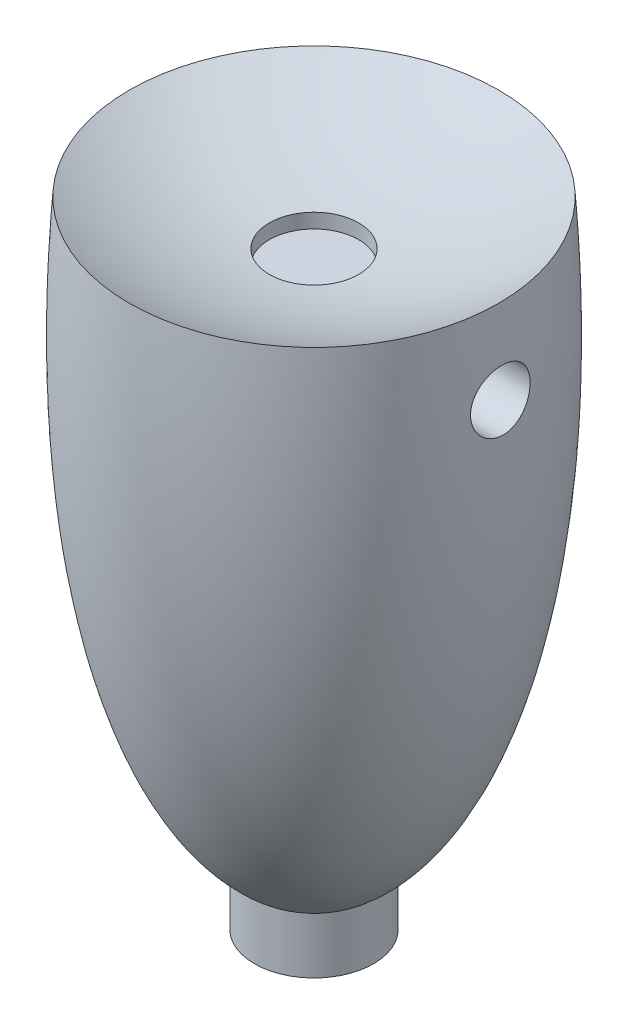
ISO-10303-21;
HEADER;
FILE_DESCRIPTION(('STEP AP214'),'2;1');
FILE_NAME('part.step','',(''),(''),'','','');
FILE_SCHEMA(('AUTOMOTIVE_DESIGN { 1 0 10303 214 1 1 1 1 }'));
ENDSEC;
DATA;
#1=APPLICATION_CONTEXT('core data for automotive mechanical design processes');
#2=APPLICATION_PROTOCOL_DEFINITION('international standard','automotive_design',2000,#1);
#3=PRODUCT_CONTEXT('',#1,'mechanical');
#4=PRODUCT('Part','Part','',(#3));
#5=PRODUCT_RELATED_PRODUCT_CATEGORY('part','',(#4));
#6=PRODUCT_DEFINITION_FORMATION('','',#4);
#7=PRODUCT_DEFINITION_CONTEXT('part definition',#1,'design');
#8=PRODUCT_DEFINITION('design','',#6,#7);
#9=PRODUCT_DEFINITION_SHAPE('','',#8);
#10=(LENGTH_UNIT() NAMED_UNIT(*) SI_UNIT(.MILLI.,.METRE.));
#11=(NAMED_UNIT(*) PLANE_ANGLE_UNIT() SI_UNIT($,.RADIAN.));
#12=(NAMED_UNIT(*) SI_UNIT($,.STERADIAN.) SOLID_ANGLE_UNIT());
#13=UNCERTAINTY_MEASURE_WITH_UNIT(LENGTH_MEASURE(1.E-05),#10,'distance_accuracy_value','');
#14=(GEOMETRIC_REPRESENTATION_CONTEXT(3) GLOBAL_UNCERTAINTY_ASSIGNED_CONTEXT((#13)) GLOBAL_UNIT_ASSIGNED_CONTEXT((#10,
#11,#12)) REPRESENTATION_CONTEXT('',''));
#15=CARTESIAN_POINT('',(0.,0.,0.));
#16=DIRECTION('',(0.,0.,1.));
#17=DIRECTION('',(1.,0.,0.));
#18=AXIS2_PLACEMENT_3D('',#15,#16,#17);
#19=CARTESIAN_POINT('',(2.02572040305098E-05,-16.0050726519191,1.83790286723869E-05));
#20=CARTESIAN_POINT('',(4.35530535164299,-15.4157836049527,1.83790286723869E-05));
#21=CARTESIAN_POINT('',(7.03015098091648,-7.28811185803329,1.83790286723869E-05));
#22=CARTESIAN_POINT('',(6.20002025720403,4.29888416358778,1.83790286723869E-05));
#23=B_SPLINE_CURVE_WITH_KNOTS('',3,(#19,#20,#21,#22),.UNSPECIFIED.,.F.,.F.,(4,4),(0.,1.),.UNSPECIFIED.);
#24=CARTESIAN_POINT('',(2.02572040305098E-05,-16.0050726519191,1.83790286723869E-05));
#25=DIRECTION('',(0.,-1.,0.));
#26=AXIS1_PLACEMENT('',#24,#25);
#27=SURFACE_OF_REVOLUTION('',#23,#26);
#28=CARTESIAN_POINT('',(2.02572040305098E-05,-15.1242181905842,1.83790286723869E-05));
#29=DIRECTION('',(0.,-1.,0.));
#30=DIRECTION('',(0.,0.,-1.));
#31=AXIS2_PLACEMENT_3D('',#28,#29,#30);
#32=CIRCLE('',#31,2.);
#33=CARTESIAN_POINT('',(2.02572040305098E-05,-15.1242181905842,-1.99998162097133));
#34=VERTEX_POINT('',#33);
#35=EDGE_CURVE('E11',#34,#34,#32,.T.);
#36=ORIENTED_EDGE('',*,*,#35,.F.);
#37=EDGE_LOOP('',(#36));
#38=FACE_BOUND('',#37,.T.);
#39=CARTESIAN_POINT('',(2.02572040305098E-05,4.29888416358773,1.83790286723869E-05));
#40=DIRECTION('',(0.,-1.,0.));
#41=DIRECTION('',(0.,0.,-1.));
#42=AXIS2_PLACEMENT_3D('',#39,#40,#41);
#43=CIRCLE('',#42,6.2);
#44=CARTESIAN_POINT('',(2.02572040305098E-05,4.29888416358773,-6.19998162097133));
#45=VERTEX_POINT('',#44);
#46=EDGE_CURVE('E50',#45,#45,#43,.T.);
#47=ORIENTED_EDGE('',*,*,#46,.T.);
#48=EDGE_LOOP('',(#47));
#49=FACE_BOUND('',#48,.T.);
#50=CARTESIAN_POINT('',(6.3495912033165,0.544256737607589,1.83790286723869E-05));
#51=CARTESIAN_POINT('',(6.34959030896667,0.544259090446466,-0.055728550571444));
#52=CARTESIAN_POINT('',(6.34882022905897,0.548934333750774,-0.111508934346287));
#53=CARTESIAN_POINT('',(6.34581258629475,0.567505641021659,-0.221510038210375));
#54=CARTESIAN_POINT('',(6.3435735490606,0.581410969296475,-0.275729134115889));
#55=CARTESIAN_POINT('',(6.33785050384924,0.618009553146522,-0.380989637589184));
#56=CARTESIAN_POINT('',(6.33436766400744,0.640694564821882,-0.432033974142083));
#57=CARTESIAN_POINT('',(6.3264925470024,0.694193106288731,-0.529592697383395));
#58=CARTESIAN_POINT('',(6.32210017800302,0.725007456994554,-0.576106625933721));
#59=CARTESIAN_POINT('',(6.31278583932466,0.794172269440273,-0.66369200737029));
#60=CARTESIAN_POINT('',(6.30785994932699,0.832580505737578,-0.704717419407674));
#61=CARTESIAN_POINT('',(6.2979728434755,0.915714354367177,-0.779770695013599));
#62=CARTESIAN_POINT('',(6.29301162501571,0.96044043740825,-0.81379803672922));
#63=CARTESIAN_POINT('',(6.28347784223696,1.05534639137865,-0.874139660933512));
#64=CARTESIAN_POINT('',(6.27890850633661,1.10556500510398,-0.90039357006457));
#65=CARTESIAN_POINT('',(6.27061866451819,1.20977091725029,-0.944074085968091));
#66=CARTESIAN_POINT('',(6.2668981264825,1.26375807297258,-0.961501026774305));
#67=CARTESIAN_POINT('',(6.26064185179901,1.37365947525791,-0.986926390531597));
#68=CARTESIAN_POINT('',(6.25809965046504,1.42956135548416,-0.994976634363456));
#69=CARTESIAN_POINT('',(6.25434930642089,1.54196597162672,-1.00156226006329));
#70=CARTESIAN_POINT('',(6.25314107655776,1.59846866804609,-1.0000982635724));
#71=CARTESIAN_POINT('',(6.25208687616801,1.70989420831577,-0.987744914484903));
#72=CARTESIAN_POINT('',(6.25222791293148,1.76482702118877,-0.976946366404056));
#73=CARTESIAN_POINT('',(6.25371163237879,1.87211054253143,-0.946355417646462));
#74=CARTESIAN_POINT('',(6.25505432132554,1.92446123754181,-0.926562970094574));
#75=CARTESIAN_POINT('',(6.25868068583165,2.02511299187063,-0.878552487539386));
#76=CARTESIAN_POINT('',(6.26096445155147,2.07341366264017,-0.850333645311323));
#77=CARTESIAN_POINT('',(6.26611638032095,2.16462588394221,-0.786269437884221));
#78=CARTESIAN_POINT('',(6.26898457193039,2.20753717094013,-0.750423699969612));
#79=CARTESIAN_POINT('',(6.27492045820847,2.28709831890935,-0.671798742241129));
#80=CARTESIAN_POINT('',(6.27798951689177,2.32369751641331,-0.628968346325403));
#81=CARTESIAN_POINT('',(6.28388616298333,2.38920594886628,-0.537767085380647));
#82=CARTESIAN_POINT('',(6.28671374710065,2.41811507902238,-0.48939614486321));
#83=CARTESIAN_POINT('',(6.29175630751614,2.46748424479267,-0.388338515025688));
#84=CARTESIAN_POINT('',(6.29396975181063,2.48792321267316,-0.335641450427179));
#85=CARTESIAN_POINT('',(6.29748156198434,2.51965095781567,-0.227532449574887));
#86=CARTESIAN_POINT('',(6.29877996475995,2.53094010402029,-0.17212062288233));
#87=CARTESIAN_POINT('',(6.3002867204417,2.54399710520788,-0.0604819230137277));
#88=CARTESIAN_POINT('',(6.30050104414608,2.54581711508346,-0.00426122841155866));
#89=CARTESIAN_POINT('',(6.29982795525487,2.54002244752305,0.107684165650433));
#90=CARTESIAN_POINT('',(6.29894056337796,2.53240794751092,0.163408874417836));
#91=CARTESIAN_POINT('',(6.29618402534586,2.50800924051689,0.272600503167583));
#92=CARTESIAN_POINT('',(6.2943179928396,2.49125410866355,0.326074006034915));
#93=CARTESIAN_POINT('',(6.28984818732674,2.44907833117433,0.429453795229778));
#94=CARTESIAN_POINT('',(6.28724438872384,2.42365738487776,0.479359957715647));
#95=CARTESIAN_POINT('',(6.28162665055429,2.36472842775693,0.574448261854674));
#96=CARTESIAN_POINT('',(6.27861082360561,2.33118261844983,0.619606865904295));
#97=CARTESIAN_POINT('',(6.27258542669528,2.25700552831831,0.703674410695849));
#98=CARTESIAN_POINT('',(6.26957585693767,2.21637401999197,0.742583150695096));
#99=CARTESIAN_POINT('',(6.26397363327177,2.12896328361614,0.813215184520069));
#100=CARTESIAN_POINT('',(6.26138283303575,2.08215830242601,0.844906771713939));
#101=CARTESIAN_POINT('',(6.25702896175766,1.98385475989298,0.899978033384513));
#102=CARTESIAN_POINT('',(6.25526586021883,1.93235637156325,0.923358014096589));
#103=CARTESIAN_POINT('',(6.25288530862948,1.82637907110713,0.961036118965212));
#104=CARTESIAN_POINT('',(6.25226262664037,1.77191495679914,0.975375519045434));
#105=CARTESIAN_POINT('',(6.25233269983085,1.66135581411757,0.994722792678918));
#106=CARTESIAN_POINT('',(6.25302539033299,1.60526086606638,0.999731125020986));
#107=CARTESIAN_POINT('',(6.25575231997115,1.4934515642831,1.00027969086361));
#108=CARTESIAN_POINT('',(6.25777716421555,1.43773728611751,0.995885747751994));
#109=CARTESIAN_POINT('',(6.26304121889218,1.3278708915338,0.977911951585128));
#110=CARTESIAN_POINT('',(6.26628045317031,1.27371880581355,0.964331918146502));
#111=CARTESIAN_POINT('',(6.27372775146923,1.16833232614178,0.928344935921071));
#112=CARTESIAN_POINT('',(6.27793853929249,1.11710664995229,0.905913042473322));
#113=CARTESIAN_POINT('',(6.28695672889183,1.01914000968267,0.852869849842209));
#114=CARTESIAN_POINT('',(6.29176415323766,0.972399215376707,0.822258241183505));
#115=CARTESIAN_POINT('',(6.30158998438859,0.884216447240205,0.753350838485131));
#116=CARTESIAN_POINT('',(6.30661004502389,0.842833493668716,0.714979727109708));
#117=CARTESIAN_POINT('',(6.31633942686997,0.767082179339451,0.631811858526723));
#118=CARTESIAN_POINT('',(6.32104875673541,0.732713623156945,0.587015280395206));
#119=CARTESIAN_POINT('',(6.32971723627047,0.671865076315981,0.492078346872507));
#120=CARTESIAN_POINT('',(6.33367388154451,0.64541125863492,0.441920990191599));
#121=CARTESIAN_POINT('',(6.34042254267594,0.601350960513764,0.337828747233902));
#122=CARTESIAN_POINT('',(6.34321582395173,0.583734862787085,0.283898040319917));
#123=CARTESIAN_POINT('',(6.34670187693355,0.561989308121691,0.191419926661687));
#124=CARTESIAN_POINT('',(6.34778054218843,0.555349693110948,0.153457969247731));
#125=CARTESIAN_POINT('',(6.34922550939118,0.546482625320605,0.0770087824168276));
#126=CARTESIAN_POINT('',(6.34959182102431,0.5442551125534,0.0385215601486232));
#127=CARTESIAN_POINT('',(6.3495912033165,0.544256737607589,1.83790286723869E-05));
#128=B_SPLINE_CURVE_WITH_KNOTS('',3,(#50,#51,#52,#53,#54,#55,#56,#57,#58,#59,#60,#61,#62,#63,
#64,#65,#66,#67,#68,#69,#70,#71,#72,#73,#74,#75,#76,#77,#78,#79,#80,#81,#82,#83,#84,#85,#86,#87,
#88,#89,#90,#91,#92,#93,#94,#95,#96,#97,#98,#99,#100,#101,#102,#103,#104,#105,#106,#107,#108,
#109,#110,#111,#112,#113,#114,#115,#116,#117,#118,#119,#120,#121,#122,#123,#124,#125,#126,#127),
.UNSPECIFIED.,.T.,.F.,(4,2,2,2,2,2,2,2,2,2,2,2,2,2,2,2,2,2,2,2,2,2,2,2,2,2,2,2,2,2,2,2,2,2,2,2,
2,2,4),(0.,0.167099795491022,0.334367564472928,0.501478652829696,0.668606622809,
0.837058754513247,1.00552344330592,1.17526413795429,1.34499840872575,1.51379011393928,
1.68257079075669,1.84972784914345,2.01688577874299,2.18405972673915,2.35124184616608,
2.51970900417597,2.68817845777793,2.85706446423176,3.02594366046082,3.19389169759414,
3.36183657637163,3.52925033357704,3.69666989979893,3.86488382310145,4.03310314827596,
4.20204782498965,4.37098627640869,4.53914772328922,4.70730090180991,4.87428072780741,
5.0412638328124,5.20872089793279,5.37618429960285,5.54535875718222,5.71452850083032,
5.88425163530753,6.0537896727276,6.16920340429548,6.28461556667014),.UNSPECIFIED.);
#129=CARTESIAN_POINT('',(6.3495912033165,0.544256737607589,1.83790286723869E-05));
#130=VERTEX_POINT('',#129);
#131=EDGE_CURVE('E86',#130,#130,#128,.T.);
#132=ORIENTED_EDGE('',*,*,#131,.F.);
#133=EDGE_LOOP('',(#132));
#134=FACE_BOUND('',#133,.T.);
#135=CARTESIAN_POINT('',(-6.25447441982605,1.54425675020453,1.00001839162548));
#136=CARTESIAN_POINT('',(-6.25588037063363,1.48824445512115,1.00001602141576));
#137=CARTESIAN_POINT('',(-6.25795890520775,1.43221472251232,0.995296349884092));
#138=CARTESIAN_POINT('',(-6.26334099937778,1.32175272194098,0.976561659600284));
#139=CARTESIAN_POINT('',(-6.26664584081726,1.26732219008086,0.96253690222426));
#140=CARTESIAN_POINT('',(-6.27420978517268,1.16167762115003,0.925631683646257));
#141=CARTESIAN_POINT('',(-6.27846798882386,1.11046061081281,0.902759553083839));
#142=CARTESIAN_POINT('',(-6.28756638007895,1.0125980420026,0.848818537108734));
#143=CARTESIAN_POINT('',(-6.29240661352475,0.965952844141041,0.81774900582107));
#144=CARTESIAN_POINT('',(-6.30226267425757,0.878185055342294,0.748023881144437));
#145=CARTESIAN_POINT('',(-6.30727952161175,0.837105039048773,0.709314825273092));
#146=CARTESIAN_POINT('',(-6.31698025505846,0.762009645327933,0.625522018035321));
#147=CARTESIAN_POINT('',(-6.32166412561593,0.727994597375059,0.580437969536152));
#148=CARTESIAN_POINT('',(-6.3302570196741,0.667925403886704,0.485022349520116));
#149=CARTESIAN_POINT('',(-6.33416414580021,0.641890670103371,0.434678375734398));
#150=CARTESIAN_POINT('',(-6.34080276346153,0.598668365399214,0.330253405502152));
#151=CARTESIAN_POINT('',(-6.34353433527623,0.581480190324481,0.276172664535106));
#152=CARTESIAN_POINT('',(-6.34752749113334,0.556603546014731,0.166384323051553));
#153=CARTESIAN_POINT('',(-6.34880346974854,0.548822006502435,0.110698337716192));
#154=CARTESIAN_POINT('',(-6.34980705435271,0.542689028433554,-0.00120266627096075));
#155=CARTESIAN_POINT('',(-6.3495347578393,0.54433699608423,-0.0574176513881415));
#156=CARTESIAN_POINT('',(-6.34747871739085,0.55695257974971,-0.168247653580134));
#157=CARTESIAN_POINT('',(-6.34570859143143,0.567836229264493,-0.222872514195852));
#158=CARTESIAN_POINT('',(-6.34084795000966,0.5984821519298,-0.329509069636902));
#159=CARTESIAN_POINT('',(-6.33775740081948,0.618244651875164,-0.381520697674004));
#160=CARTESIAN_POINT('',(-6.33053800073638,0.666172069571569,-0.481712473859444));
#161=CARTESIAN_POINT('',(-6.32640473912973,0.694372778029111,-0.529875171581557));
#162=CARTESIAN_POINT('',(-6.3175007399868,0.758344137414429,-0.620813768982508));
#163=CARTESIAN_POINT('',(-6.31272995515456,0.794115350090633,-0.663589268543225));
#164=CARTESIAN_POINT('',(-6.30294054099798,0.872704086427847,-0.743067439541817));
#165=CARTESIAN_POINT('',(-6.29791966265581,0.915599260564268,-0.779693083301351));
#166=CARTESIAN_POINT('',(-6.28815472925987,1.00694962005155,-0.845239883335134));
#167=CARTESIAN_POINT('',(-6.28341068114135,1.05540494460697,-0.874160846653873));
#168=CARTESIAN_POINT('',(-6.27461968906973,1.15671133042835,-0.923558785412949));
#169=CARTESIAN_POINT('',(-6.27057516650575,1.20957675694882,-0.94400675969123));
#170=CARTESIAN_POINT('',(-6.26355948984657,1.31806514016425,-0.975702076191464));
#171=CARTESIAN_POINT('',(-6.2605882704936,1.37368792897526,-0.986949977838406));
#172=CARTESIAN_POINT('',(-6.25597011197633,1.4855996317112,-0.999833791927824));
#173=CARTESIAN_POINT('',(-6.25431189896254,1.54187856912519,-1.00155231086604));
#174=CARTESIAN_POINT('',(-6.2523529826811,1.65395060522796,-0.995529717461074));
#175=CARTESIAN_POINT('',(-6.25205221739476,1.70974372599634,-0.987789037307558));
#176=CARTESIAN_POINT('',(-6.25272435669183,1.81882896960914,-0.963160665922629));
#177=CARTESIAN_POINT('',(-6.25368787465989,1.87213651545728,-0.946340925396536));
#178=CARTESIAN_POINT('',(-6.25665272428641,1.97518724895425,-0.904083633091514));
#179=CARTESIAN_POINT('',(-6.25865408345793,2.02493034206995,-0.87864585285529));
#180=CARTESIAN_POINT('',(-6.26337576556656,2.11965062728251,-0.819764222798486));
#181=CARTESIAN_POINT('',(-6.2660987799678,2.16460907615558,-0.786290447107544));
#182=CARTESIAN_POINT('',(-6.27186173784643,2.24830491673276,-0.712326669591565));
#183=CARTESIAN_POINT('',(-6.27490169600962,2.28704201995512,-0.671836342592222));
#184=CARTESIAN_POINT('',(-6.2809019191564,2.35748204475684,-0.584642472460426));
#185=CARTESIAN_POINT('',(-6.28386144566614,2.3891318765314,-0.537895970406602));
#186=CARTESIAN_POINT('',(-6.28927818315289,2.44413936104607,-0.439728020144324));
#187=CARTESIAN_POINT('',(-6.29173539898408,2.46749709392006,-0.388306617119595));
#188=CARTESIAN_POINT('',(-6.29582012183502,2.50523148569307,-0.282278454256163));
#189=CARTESIAN_POINT('',(-6.29744824905067,2.51961485963947,-0.227674109580976));
#190=CARTESIAN_POINT('',(-6.29966333809515,2.53900241361561,-0.116805060898456));
#191=CARTESIAN_POINT('',(-6.30025034212217,2.5440069737825,-0.0605404242790989));
#192=CARTESIAN_POINT('',(-6.30030620126665,2.54448682154867,0.0516869875288485));
#193=CARTESIAN_POINT('',(-6.29978182412775,2.54001978625612,0.107649521193672));
#194=CARTESIAN_POINT('',(-6.2976967419831,2.52180604064388,0.21802286589571));
#195=CARTESIAN_POINT('',(-6.29613603561074,2.50805931808686,0.272433674886532));
#196=CARTESIAN_POINT('',(-6.29218181449528,2.47169515209279,0.37814723644837));
#197=CARTESIAN_POINT('',(-6.28978862853492,2.44908121026192,0.42945120666842));
#198=CARTESIAN_POINT('',(-6.2844820196006,2.39562805678217,0.52754768754386));
#199=CARTESIAN_POINT('',(-6.28156859013234,2.36478874245222,0.574340141870015));
#200=CARTESIAN_POINT('',(-6.27559027200116,2.29553740269586,0.662387856520169));
#201=CARTESIAN_POINT('',(-6.27252457802689,2.25708096218809,0.703608133756045));
#202=CARTESIAN_POINT('',(-6.26668364974804,2.1737864701837,0.779022979527065));
#203=CARTESIAN_POINT('',(-6.26390840735087,2.12894859656935,0.813217743833281));
#204=CARTESIAN_POINT('',(-6.25905145272151,2.03404145311699,0.873680083156547));
#205=CARTESIAN_POINT('',(-6.25697129072024,1.98396081254349,0.89992992658142));
#206=CARTESIAN_POINT('',(-6.25386096006098,1.88010339962441,0.94361468475546));
#207=CARTESIAN_POINT('',(-6.25282966651625,1.82633065321162,0.961059033052563));
#208=CARTESIAN_POINT('',(-6.25216921349661,1.73428353357745,0.982542684732672));
#209=CARTESIAN_POINT('',(-6.25219615745178,1.69657696170263,0.989087753944472));
#210=CARTESIAN_POINT('',(-6.25286921412571,1.62066854515158,0.997826395902239));
#211=CARTESIAN_POINT('',(-6.253515321172,1.58246670501589,1.00002000851346));
#212=CARTESIAN_POINT('',(-6.25447441982605,1.54425675020453,1.00001839162548));
#213=B_SPLINE_CURVE_WITH_KNOTS('',3,(#135,#136,#137,#138,#139,#140,#141,#142,#143,#144,#145,
#146,#147,#148,#149,#150,#151,#152,#153,#154,#155,#156,#157,#158,#159,#160,#161,#162,#163,#164,
#165,#166,#167,#168,#169,#170,#171,#172,#173,#174,#175,#176,#177,#178,#179,#180,#181,#182,#183,
#184,#185,#186,#187,#188,#189,#190,#191,#192,#193,#194,#195,#196,#197,#198,#199,#200,#201,#202,
#203,#204,#205,#206,#207,#208,#209,#210,#211,#212),.UNSPECIFIED.,.T.,.F.,(4,2,2,2,2,2,2,2,2,2,2,
2,2,2,2,2,2,2,2,2,2,2,2,2,2,2,2,2,2,2,2,2,2,2,2,2,2,2,4),(0.,0.167949634648066,
0.336075321818111,0.504043086578021,0.672024089508595,0.841225229518723,1.01043425844476,
1.18005167288545,1.34965750218562,1.51757112537265,1.68547417485829,1.85186688386816,
2.01826384333293,2.18537682955857,2.35250222029374,2.521585814145,2.69067364211672,
2.86033553264726,3.0299871058507,3.19816570932768,3.36633662903176,3.53326600842022,
3.70019981331843,3.86776519185713,4.03533833810571,4.20412762214709,4.37291527498422,
4.54157648083858,4.71023085045781,4.87786115289653,5.04549167639332,5.21305607026412,
5.38062255601543,5.54919651204012,5.71776576999057,5.88670851527796,6.05546988177215,
6.17004127602341,6.28461162064032),.UNSPECIFIED.);
#214=CARTESIAN_POINT('',(-6.25447441982605,1.54425675020453,1.00001839162548));
#215=VERTEX_POINT('',#214);
#216=EDGE_CURVE('E81',#215,#215,#213,.T.);
#217=ORIENTED_EDGE('',*,*,#216,.T.);
#218=EDGE_LOOP('',(#217));
#219=FACE_BOUND('',#218,.T.);
#220=ADVANCED_FACE('F42',(#38,#49,#134,#219),#27,.F.);
#221=CARTESIAN_POINT('',(2.02572040305098E-05,15.5113841635877,1.83790286723869E-05));
#222=DIRECTION('',(0.,0.,1.));
#223=DIRECTION('',(1.,0.,0.));
#224=AXIS2_PLACEMENT_3D('',#221,#222,#223);
#225=SPHERICAL_SURFACE('',#224,12.8125);
#226=CARTESIAN_POINT('',(2.02572040305098E-05,15.5113841635877,1.83790286723869E-05));
#227=DIRECTION('',(0.,1.,0.));
#228=DIRECTION('',(0.,0.,1.));
#229=AXIS2_PLACEMENT_3D('',#226,#227,#228);
#230=SPHERICAL_SURFACE('',#229,12.8125);
#231=CARTESIAN_POINT('',(2.02572040305098E-05,2.78699198753468,1.83790286723869E-05));
#232=DIRECTION('',(0.,1.,0.));
#233=DIRECTION('',(0.,0.,1.));
#234=AXIS2_PLACEMENT_3D('',#231,#232,#233);
#235=CIRCLE('',#234,1.5);
#236=CARTESIAN_POINT('',(2.02572040305098E-05,2.78699198753468,1.50001837902867));
#237=VERTEX_POINT('',#236);
#238=EDGE_CURVE('E76',#237,#237,#235,.T.);
#239=ORIENTED_EDGE('',*,*,#238,.F.);
#240=EDGE_LOOP('',(#239));
#241=FACE_BOUND('',#240,.T.);
#242=ORIENTED_EDGE('',*,*,#46,.F.);
#243=EDGE_LOOP('',(#242));
#244=FACE_BOUND('',#243,.T.);
#245=ADVANCED_FACE('F44',(#241,#244),#230,.F.);
#246=CARTESIAN_POINT('',(4.33395297631232,1.54425675020453,1.83790286723869E-05));
#247=DIRECTION('',(1.,0.,0.));
#248=DIRECTION('',(0.,0.,-1.));
#249=AXIS2_PLACEMENT_3D('',#246,#247,#248);
#250=CYLINDRICAL_SURFACE('',#249,1.00000001259695);
#251=ORIENTED_EDGE('',*,*,#131,.T.);
#252=EDGE_LOOP('',(#251));
#253=FACE_BOUND('',#252,.T.);
#254=CARTESIAN_POINT('',(4.33395297631232,1.54425675020453,1.83790286723869E-05));
#255=DIRECTION('',(1.,0.,0.));
#256=DIRECTION('',(0.,0.,-1.));
#257=AXIS2_PLACEMENT_3D('',#254,#255,#256);
#258=CIRCLE('',#257,1.00000001259695);
#259=CARTESIAN_POINT('',(4.33395297631232,1.54425675020453,-0.999981633568273));
#260=VERTEX_POINT('',#259);
#261=EDGE_CURVE('E82',#260,#260,#258,.T.);
#262=ORIENTED_EDGE('',*,*,#261,.F.);
#263=EDGE_LOOP('',(#262));
#264=FACE_BOUND('',#263,.T.);
#265=ADVANCED_FACE('F99',(#253,#264),#250,.F.);
#266=CARTESIAN_POINT('',(4.33395297631232,1.54425675020453,1.83790286723869E-05));
#267=DIRECTION('',(1.,0.,0.));
#268=DIRECTION('',(0.,0.,-1.));
#269=AXIS2_PLACEMENT_3D('',#266,#267,#268);
#270=PLANE('',#269);
#271=ORIENTED_EDGE('',*,*,#261,.T.);
#272=EDGE_LOOP('',(#271));
#273=FACE_BOUND('',#272,.T.);
#274=ADVANCED_FACE('F118',(#273),#270,.T.);
#275=CARTESIAN_POINT('',(-4.33391246190426,1.54425675020453,1.83790286723869E-05));
#276=DIRECTION('',(-1.,0.,0.));
#277=DIRECTION('',(0.,0.,1.));
#278=AXIS2_PLACEMENT_3D('',#275,#276,#277);
#279=CYLINDRICAL_SURFACE('',#278,1.00000001259695);
#280=ORIENTED_EDGE('',*,*,#216,.F.);
#281=EDGE_LOOP('',(#280));
#282=FACE_BOUND('',#281,.T.);
#283=CARTESIAN_POINT('',(-4.33391246190426,1.54425675020453,1.83790286723869E-05));
#284=DIRECTION('',(1.,0.,0.));
#285=DIRECTION('',(0.,0.,-1.));
#286=AXIS2_PLACEMENT_3D('',#283,#284,#285);
#287=CIRCLE('',#286,1.00000001259695);
#288=CARTESIAN_POINT('',(-4.33391246190426,1.54425675020453,-0.999981633568273));
#289=VERTEX_POINT('',#288);
#290=EDGE_CURVE('E77',#289,#289,#287,.T.);
#291=ORIENTED_EDGE('',*,*,#290,.T.);
#292=EDGE_LOOP('',(#291));
#293=FACE_BOUND('',#292,.T.);
#294=ADVANCED_FACE('F113',(#282,#293),#279,.F.);
#295=CARTESIAN_POINT('',(-4.33391246190426,1.54425675020453,1.83790286723869E-05));
#296=DIRECTION('',(-1.,0.,0.));
#297=DIRECTION('',(0.,0.,-1.));
#298=AXIS2_PLACEMENT_3D('',#295,#296,#297);
#299=PLANE('',#298);
#300=ORIENTED_EDGE('',*,*,#290,.F.);
#301=EDGE_LOOP('',(#300));
#302=FACE_BOUND('',#301,.T.);
#303=ADVANCED_FACE('F117',(#302),#299,.T.);
#304=CARTESIAN_POINT('',(2.02572040305098E-05,2.29888416358773,1.83790286723869E-05));
#305=DIRECTION('',(0.,1.,0.));
#306=DIRECTION('',(0.,0.,1.));
#307=AXIS2_PLACEMENT_3D('',#304,#305,#306);
#308=CYLINDRICAL_SURFACE('',#307,1.5);
#309=ORIENTED_EDGE('',*,*,#238,.T.);
#310=EDGE_LOOP('',(#309));
#311=FACE_BOUND('',#310,.T.);
#312=CARTESIAN_POINT('',(2.02572040305098E-05,2.29888416358773,1.83790286723869E-05));
#313=DIRECTION('',(0.,1.,0.));
#314=DIRECTION('',(0.,0.,1.));
#315=AXIS2_PLACEMENT_3D('',#312,#313,#314);
#316=CIRCLE('',#315,1.5);
#317=CARTESIAN_POINT('',(2.02572040305098E-05,2.29888416358773,1.50001837902867));
#318=VERTEX_POINT('',#317);
#319=EDGE_CURVE('E72',#318,#318,#316,.T.);
#320=ORIENTED_EDGE('',*,*,#319,.F.);
#321=EDGE_LOOP('',(#320));
#322=FACE_BOUND('',#321,.T.);
#323=ADVANCED_FACE('F148',(#311,#322),#308,.F.);
#324=CARTESIAN_POINT('',(2.02572040305098E-05,2.29888416358773,1.83790286723869E-05));
#325=DIRECTION('',(0.,1.,0.));
#326=DIRECTION('',(0.,0.,1.));
#327=AXIS2_PLACEMENT_3D('',#324,#325,#326);
#328=PLANE('',#327);
#329=ORIENTED_EDGE('',*,*,#319,.T.);
#330=EDGE_LOOP('',(#329));
#331=FACE_BOUND('',#330,.T.);
#332=ADVANCED_FACE('F152',(#331),#328,.T.);
#333=CARTESIAN_POINT('',(2.02572040305098E-05,-17.0050726519191,1.83790286723869E-05));
#334=DIRECTION('',(0.,1.,0.));
#335=DIRECTION('',(0.,0.,1.));
#336=AXIS2_PLACEMENT_3D('',#333,#334,#335);
#337=CYLINDRICAL_SURFACE('',#336,2.);
#338=CARTESIAN_POINT('',(2.02572040305098E-05,-17.0050726519191,1.83790286723869E-05));
#339=DIRECTION('',(0.,1.,0.));
#340=DIRECTION('',(0.,0.,1.));
#341=AXIS2_PLACEMENT_3D('',#338,#339,#340);
#342=CIRCLE('',#341,2.);
#343=CARTESIAN_POINT('',(2.02572040305098E-05,-17.0050726519191,2.00001837902867));
#344=VERTEX_POINT('',#343);
#345=EDGE_CURVE('E66',#344,#344,#342,.T.);
#346=ORIENTED_EDGE('',*,*,#345,.T.);
#347=EDGE_LOOP('',(#346));
#348=FACE_BOUND('',#347,.T.);
#349=ORIENTED_EDGE('',*,*,#35,.T.);
#350=EDGE_LOOP('',(#349));
#351=FACE_BOUND('',#350,.T.);
#352=ADVANCED_FACE('F157',(#348,#351),#337,.T.);
#353=CARTESIAN_POINT('',(2.02572040305098E-05,-17.0050726519191,1.83790286723869E-05));
#354=DIRECTION('',(0.,1.,0.));
#355=DIRECTION('',(0.,0.,1.));
#356=AXIS2_PLACEMENT_3D('',#353,#354,#355);
#357=PLANE('',#356);
#358=CARTESIAN_POINT('',(2.02572040305098E-05,-17.0050726519191,1.83790286723869E-05));
#359=DIRECTION('',(0.,1.,0.));
#360=DIRECTION('',(0.,0.,1.));
#361=AXIS2_PLACEMENT_3D('',#358,#359,#360);
#362=CIRCLE('',#361,0.9);
#363=CARTESIAN_POINT('',(2.02572040305098E-05,-17.0050726519191,0.900018379028672));
#364=VERTEX_POINT('',#363);
#365=EDGE_CURVE('E62',#364,#364,#362,.T.);
#366=ORIENTED_EDGE('',*,*,#365,.T.);
#367=EDGE_LOOP('',(#366));
#368=FACE_BOUND('',#367,.T.);
#369=ORIENTED_EDGE('',*,*,#345,.F.);
#370=EDGE_LOOP('',(#369));
#371=FACE_BOUND('',#370,.T.);
#372=ADVANCED_FACE('F165',(#368,#371),#357,.F.);
#373=CARTESIAN_POINT('',(2.02572040305098E-05,-17.0050726519191,1.83790286723869E-05));
#374=DIRECTION('',(0.,1.,0.));
#375=DIRECTION('',(0.,0.,1.));
#376=AXIS2_PLACEMENT_3D('',#373,#374,#375);
#377=CYLINDRICAL_SURFACE('',#376,0.9);
#378=ORIENTED_EDGE('',*,*,#365,.F.);
#379=EDGE_LOOP('',(#378));
#380=FACE_BOUND('',#379,.T.);
#381=CARTESIAN_POINT('',(2.02572040305098E-05,-15.7676529296803,1.83790286723869E-05));
#382=DIRECTION('',(0.,-1.,0.));
#383=DIRECTION('',(0.,0.,-1.));
#384=AXIS2_PLACEMENT_3D('',#381,#382,#383);
#385=CIRCLE('',#384,0.900000000000034);
#386=CARTESIAN_POINT('',(2.02572040305098E-05,-15.7676529296803,-0.899981620971361));
#387=VERTEX_POINT('',#386);
#388=EDGE_CURVE('E59',#387,#387,#385,.T.);
#389=ORIENTED_EDGE('',*,*,#388,.F.);
#390=EDGE_LOOP('',(#389));
#391=FACE_BOUND('',#390,.T.);
#392=ADVANCED_FACE('F56',(#380,#391),#377,.F.);
#393=CARTESIAN_POINT('',(2.02572040305098E-05,-16.0050726519191,1.83790286723869E-05));
#394=VERTEX_POINT('',#393);
#395=VERTEX_LOOP('',#394);
#396=FACE_BOUND('',#395,.T.);
#397=ORIENTED_EDGE('',*,*,#388,.T.);
#398=EDGE_LOOP('',(#397));
#399=FACE_BOUND('',#398,.T.);
#400=ADVANCED_FACE('F53',(#396,#399),#27,.F.);
#401=CLOSED_SHELL('',(#220,#245,#265,#274,#294,#303,#323,#332,#352,#372,#392,#400));
#402=MANIFOLD_SOLID_BREP('B2',#401);
#403=ADVANCED_BREP_SHAPE_REPRESENTATION('',(#18,#402),#14);
#404=SHAPE_DEFINITION_REPRESENTATION(#9,#403);
ENDSEC;
END-ISO-10303-21;
